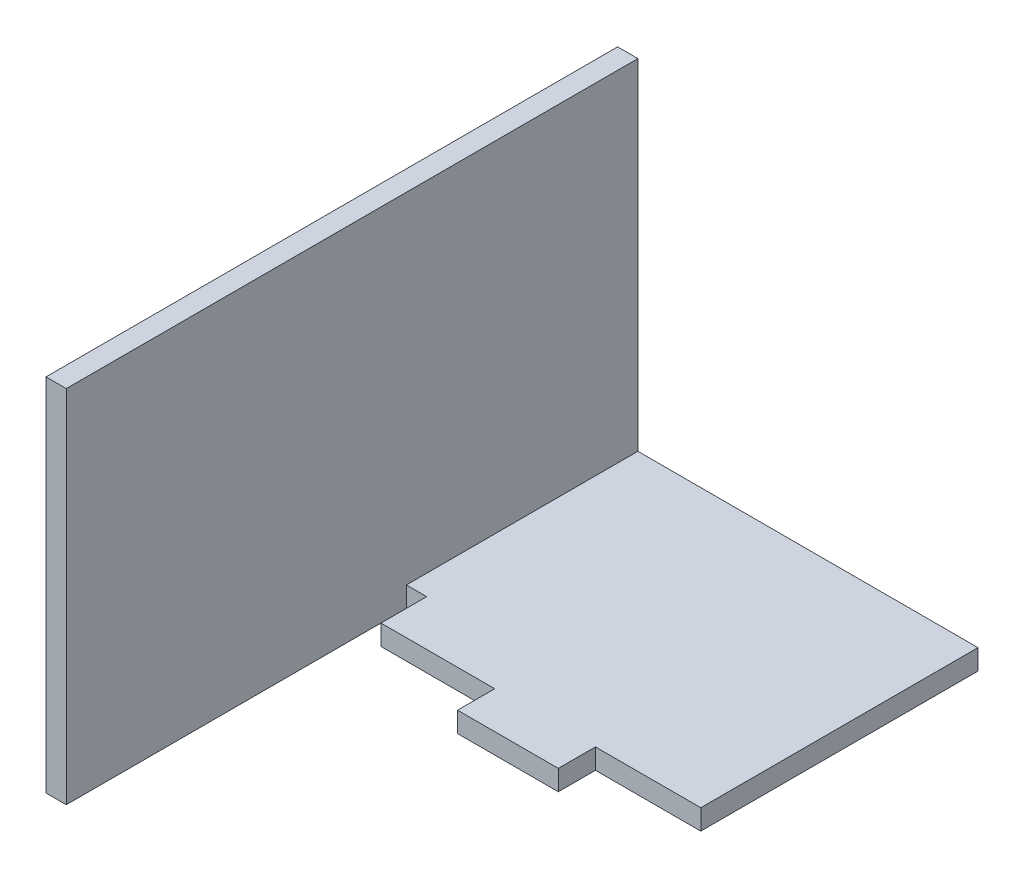
ISO-10303-21;
HEADER;
FILE_DESCRIPTION(('STEP AP214'),'2;1');
FILE_NAME('part.step','',(''),(''),'','','');
FILE_SCHEMA(('AUTOMOTIVE_DESIGN { 1 0 10303 214 1 1 1 1 }'));
ENDSEC;
DATA;
#1=APPLICATION_CONTEXT('core data for automotive mechanical design processes');
#2=APPLICATION_PROTOCOL_DEFINITION('international standard','automotive_design',2000,#1);
#3=PRODUCT_CONTEXT('',#1,'mechanical');
#4=PRODUCT('Part','Part','',(#3));
#5=PRODUCT_RELATED_PRODUCT_CATEGORY('part','',(#4));
#6=PRODUCT_DEFINITION_FORMATION('','',#4);
#7=PRODUCT_DEFINITION_CONTEXT('part definition',#1,'design');
#8=PRODUCT_DEFINITION('design','',#6,#7);
#9=PRODUCT_DEFINITION_SHAPE('','',#8);
#10=(LENGTH_UNIT() NAMED_UNIT(*) SI_UNIT(.MILLI.,.METRE.));
#11=(NAMED_UNIT(*) PLANE_ANGLE_UNIT() SI_UNIT($,.RADIAN.));
#12=(NAMED_UNIT(*) SI_UNIT($,.STERADIAN.) SOLID_ANGLE_UNIT());
#13=UNCERTAINTY_MEASURE_WITH_UNIT(LENGTH_MEASURE(1.E-05),#10,'distance_accuracy_value','');
#14=(GEOMETRIC_REPRESENTATION_CONTEXT(3) GLOBAL_UNCERTAINTY_ASSIGNED_CONTEXT((#13)) GLOBAL_UNIT_ASSIGNED_CONTEXT((#10,
#11,#12)) REPRESENTATION_CONTEXT('',''));
#15=CARTESIAN_POINT('',(0.,0.,0.));
#16=DIRECTION('',(0.,0.,1.));
#17=DIRECTION('',(1.,0.,0.));
#18=AXIS2_PLACEMENT_3D('',#15,#16,#17);
#19=CARTESIAN_POINT('',(1.42,-4.24660306919122E-12,40.0000000000007));
#20=DIRECTION('',(0.,-1.00000000000004,0.));
#21=DIRECTION('',(0.,0.,-1.00000000000004));
#22=AXIS2_PLACEMENT_3D('',#19,#20,#21);
#23=PLANE('',#22);
#24=DIRECTION('',(-1.,0.,0.));
#25=VECTOR('',#24,1.);
#26=CARTESIAN_POINT('',(1.42,0.,0.));
#27=LINE('',#26,#25);
#28=CARTESIAN_POINT('',(1.42,0.,0.));
#29=VERTEX_POINT('',#28);
#30=CARTESIAN_POINT('',(0.,0.,0.));
#31=VERTEX_POINT('',#30);
#32=EDGE_CURVE('E206',#29,#31,#27,.T.);
#33=ORIENTED_EDGE('',*,*,#32,.T.);
#34=DIRECTION('',(0.,0.,-1.00000000000004));
#35=VECTOR('',#34,1.);
#36=CARTESIAN_POINT('',(0.,-4.85722573273506E-12,40.0000000000005));
#37=LINE('',#36,#35);
#38=CARTESIAN_POINT('',(0.,-4.85722573273506E-12,40.0000000000005));
#39=VERTEX_POINT('',#38);
#40=EDGE_CURVE('E12',#39,#31,#37,.T.);
#41=ORIENTED_EDGE('',*,*,#40,.F.);
#42=DIRECTION('',(-1.,0.,0.));
#43=VECTOR('',#42,1.);
#44=CARTESIAN_POINT('',(1.42,-4.24660306919122E-12,40.0000000000007));
#45=LINE('',#44,#43);
#46=CARTESIAN_POINT('',(1.42,-4.24660306919122E-12,40.0000000000007));
#47=VERTEX_POINT('',#46);
#48=EDGE_CURVE('E213',#47,#39,#45,.T.);
#49=ORIENTED_EDGE('',*,*,#48,.F.);
#50=DIRECTION('',(0.,0.,-1.00000000000004));
#51=VECTOR('',#50,1.);
#52=CARTESIAN_POINT('',(1.42,-4.24660306919122E-12,40.0000000000007));
#53=LINE('',#52,#51);
#54=EDGE_CURVE('E185',#47,#29,#53,.T.);
#55=ORIENTED_EDGE('',*,*,#54,.T.);
#56=EDGE_LOOP('',(#33,#41,#49,#55));
#57=FACE_BOUND('',#56,.T.);
#58=ADVANCED_FACE('F61',(#57),#23,.F.);
#59=CARTESIAN_POINT('',(0.,-4.85722573273506E-12,40.0000000000005));
#60=DIRECTION('',(1.,0.,0.));
#61=DIRECTION('',(0.,0.,-1.00000000000004));
#62=AXIS2_PLACEMENT_3D('',#59,#60,#61);
#63=PLANE('',#62);
#64=DIRECTION('',(0.,-1.00000000000004,0.));
#65=VECTOR('',#64,1.);
#66=CARTESIAN_POINT('',(0.,0.,0.));
#67=LINE('',#66,#65);
#68=CARTESIAN_POINT('',(0.,-25.2200000000097,-4.85722573273506E-13));
#69=VERTEX_POINT('',#68);
#70=EDGE_CURVE('E202',#31,#69,#67,.T.);
#71=ORIENTED_EDGE('',*,*,#70,.T.);
#72=DIRECTION('',(0.,0.,-1.00000000000004));
#73=VECTOR('',#72,1.);
#74=CARTESIAN_POINT('',(0.,-25.22,39.9999999999995));
#75=LINE('',#74,#73);
#76=CARTESIAN_POINT('',(0.,-25.22,39.9999999999995));
#77=VERTEX_POINT('',#76);
#78=EDGE_CURVE('E68',#77,#69,#75,.T.);
#79=ORIENTED_EDGE('',*,*,#78,.F.);
#80=DIRECTION('',(0.,-1.00000000000004,0.));
#81=VECTOR('',#80,1.);
#82=CARTESIAN_POINT('',(0.,-4.85722573273506E-12,40.0000000000005));
#83=LINE('',#82,#81);
#84=EDGE_CURVE('E80',#39,#77,#83,.T.);
#85=ORIENTED_EDGE('',*,*,#84,.F.);
#86=ORIENTED_EDGE('',*,*,#40,.T.);
#87=EDGE_LOOP('',(#71,#79,#85,#86));
#88=FACE_BOUND('',#87,.T.);
#89=ADVANCED_FACE('F306',(#88),#63,.F.);
#90=CARTESIAN_POINT('',(25.22,-25.2200000000049,40.));
#91=DIRECTION('',(0.,1.00000000000004,0.));
#92=DIRECTION('',(-1.,0.,0.));
#93=AXIS2_PLACEMENT_3D('',#90,#91,#92);
#94=PLANE('',#93);
#95=DIRECTION('',(-1.,0.,0.));
#96=VECTOR('',#95,1.);
#97=CARTESIAN_POINT('',(1.4199999999994,-25.2200000000002,16.2000000000002));
#98=LINE('',#97,#96);
#99=CARTESIAN_POINT('',(2.84000000000001,-25.2200000000005,16.2000000000006));
#100=VERTEX_POINT('',#99);
#101=CARTESIAN_POINT('',(1.4199999999994,-25.2200000000002,16.2000000000002));
#102=VERTEX_POINT('',#101);
#103=EDGE_CURVE('E239',#100,#102,#98,.T.);
#104=ORIENTED_EDGE('',*,*,#103,.T.);
#105=DIRECTION('',(0.,0.,1.00000000000004));
#106=VECTOR('',#105,1.);
#107=CARTESIAN_POINT('',(1.42,-25.22,39.9999999999995));
#108=LINE('',#107,#106);
#109=CARTESIAN_POINT('',(1.42,-25.22,39.9999999999995));
#110=VERTEX_POINT('',#109);
#111=EDGE_CURVE('E165',#102,#110,#108,.T.);
#112=ORIENTED_EDGE('',*,*,#111,.T.);
#113=DIRECTION('',(1.,0.,0.));
#114=VECTOR('',#113,1.);
#115=CARTESIAN_POINT('',(25.22,-25.2200000000049,40.));
#116=LINE('',#115,#114);
#117=EDGE_CURVE('E197',#77,#110,#116,.T.);
#118=ORIENTED_EDGE('',*,*,#117,.F.);
#119=ORIENTED_EDGE('',*,*,#78,.T.);
#120=DIRECTION('',(1.,0.,0.));
#121=VECTOR('',#120,1.);
#122=CARTESIAN_POINT('',(25.22,-25.2200000000048,0.));
#123=LINE('',#122,#121);
#124=CARTESIAN_POINT('',(25.22,-25.2200000000048,0.));
#125=VERTEX_POINT('',#124);
#126=EDGE_CURVE('E195',#69,#125,#123,.T.);
#127=ORIENTED_EDGE('',*,*,#126,.T.);
#128=DIRECTION('',(0.,0.,-1.00000000000004));
#129=VECTOR('',#128,1.);
#130=CARTESIAN_POINT('',(25.22,-25.2200000000049,40.));
#131=LINE('',#130,#129);
#132=CARTESIAN_POINT('',(25.2199999999994,-25.2200000000048,19.4000000000002));
#133=VERTEX_POINT('',#132);
#134=EDGE_CURVE('E181',#133,#125,#131,.T.);
#135=ORIENTED_EDGE('',*,*,#134,.F.);
#136=DIRECTION('',(-1.,0.,0.));
#137=VECTOR('',#136,1.);
#138=CARTESIAN_POINT('',(17.8499999999994,-25.2200000000048,19.4));
#139=LINE('',#138,#137);
#140=CARTESIAN_POINT('',(17.8499999999994,-25.2200000000048,19.4));
#141=VERTEX_POINT('',#140);
#142=EDGE_CURVE('E160',#133,#141,#139,.T.);
#143=ORIENTED_EDGE('',*,*,#142,.T.);
#144=DIRECTION('',(0.,0.,1.00000000000004));
#145=VECTOR('',#144,1.);
#146=CARTESIAN_POINT('',(17.8499999999994,-25.22,22.));
#147=LINE('',#146,#145);
#148=CARTESIAN_POINT('',(17.8499999999994,-25.22,22.));
#149=VERTEX_POINT('',#148);
#150=EDGE_CURVE('E253',#141,#149,#147,.T.);
#151=ORIENTED_EDGE('',*,*,#150,.T.);
#152=DIRECTION('',(-1.,0.,0.));
#153=VECTOR('',#152,1.);
#154=CARTESIAN_POINT('',(10.7999999999996,-25.22,22.));
#155=LINE('',#154,#153);
#156=CARTESIAN_POINT('',(10.7999999999996,-25.22,22.));
#157=VERTEX_POINT('',#156);
#158=EDGE_CURVE('E250',#149,#157,#155,.T.);
#159=ORIENTED_EDGE('',*,*,#158,.T.);
#160=DIRECTION('',(0.,0.,-1.00000000000004));
#161=VECTOR('',#160,1.);
#162=CARTESIAN_POINT('',(10.7999999999996,-25.2200000000049,19.3999999999999));
#163=LINE('',#162,#161);
#164=CARTESIAN_POINT('',(10.7999999999996,-25.2200000000049,19.3999999999999));
#165=VERTEX_POINT('',#164);
#166=EDGE_CURVE('E247',#157,#165,#163,.T.);
#167=ORIENTED_EDGE('',*,*,#166,.T.);
#168=DIRECTION('',(-1.,0.,0.));
#169=VECTOR('',#168,1.);
#170=CARTESIAN_POINT('',(2.8399999999994,-25.22,19.4));
#171=LINE('',#170,#169);
#172=CARTESIAN_POINT('',(2.8399999999994,-25.22,19.4));
#173=VERTEX_POINT('',#172);
#174=EDGE_CURVE('E244',#165,#173,#171,.T.);
#175=ORIENTED_EDGE('',*,*,#174,.T.);
#176=DIRECTION('',(0.,0.,-1.00000000000004));
#177=VECTOR('',#176,1.);
#178=CARTESIAN_POINT('',(2.84000000000001,-25.2200000000005,16.2000000000006));
#179=LINE('',#178,#177);
#180=EDGE_CURVE('E241',#173,#100,#179,.T.);
#181=ORIENTED_EDGE('',*,*,#180,.T.);
#182=EDGE_LOOP('',(#104,#112,#118,#119,#127,#135,#143,#151,#159,#167,#175,#181));
#183=FACE_BOUND('',#182,.T.);
#184=ADVANCED_FACE('F194',(#183),#94,.F.);
#185=CARTESIAN_POINT('',(25.22,-25.2200000000049,40.));
#186=DIRECTION('',(-1.,0.,0.));
#187=DIRECTION('',(0.,0.,1.00000000000004));
#188=AXIS2_PLACEMENT_3D('',#185,#186,#187);
#189=PLANE('',#188);
#190=DIRECTION('',(0.,0.,-1.00000000000004));
#191=VECTOR('',#190,1.);
#192=CARTESIAN_POINT('',(25.22,-23.8000000000005,40.0000000000011));
#193=LINE('',#192,#191);
#194=CARTESIAN_POINT('',(25.2199999999994,-23.8000000000048,19.3999999999999));
#195=VERTEX_POINT('',#194);
#196=CARTESIAN_POINT('',(25.2199999999994,-23.8000000000004,-1.12410081243297E-12));
#197=VERTEX_POINT('',#196);
#198=EDGE_CURVE('E171',#195,#197,#193,.T.);
#199=ORIENTED_EDGE('',*,*,#198,.F.);
#200=DIRECTION('',(0.,1.00000000000004,0.));
#201=VECTOR('',#200,1.);
#202=CARTESIAN_POINT('',(25.2199999999994,-25.2200000000048,19.4000000000002));
#203=LINE('',#202,#201);
#204=EDGE_CURVE('E154',#133,#195,#203,.T.);
#205=ORIENTED_EDGE('',*,*,#204,.F.);
#206=ORIENTED_EDGE('',*,*,#134,.T.);
#207=DIRECTION('',(0.,1.00000000000004,0.));
#208=VECTOR('',#207,1.);
#209=CARTESIAN_POINT('',(25.22,-25.2200000000048,0.));
#210=LINE('',#209,#208);
#211=EDGE_CURVE('E179',#125,#197,#210,.T.);
#212=ORIENTED_EDGE('',*,*,#211,.T.);
#213=EDGE_LOOP('',(#199,#205,#206,#212));
#214=FACE_BOUND('',#213,.T.);
#215=ADVANCED_FACE('F177',(#214),#189,.F.);
#216=CARTESIAN_POINT('',(25.22,-23.8000000000005,40.0000000000011));
#217=DIRECTION('',(0.,-1.00000000000004,0.));
#218=DIRECTION('',(1.,0.,0.));
#219=AXIS2_PLACEMENT_3D('',#216,#217,#218);
#220=PLANE('',#219);
#221=DIRECTION('',(0.,0.,-1.00000000000004));
#222=VECTOR('',#221,1.);
#223=CARTESIAN_POINT('',(1.42,-23.8000000000049,40.0000000000006));
#224=LINE('',#223,#222);
#225=CARTESIAN_POINT('',(1.42,-23.8000000000058,16.2000000000002));
#226=VERTEX_POINT('',#225);
#227=CARTESIAN_POINT('',(1.42,-23.8000000000031,-8.46545056276682E-13));
#228=VERTEX_POINT('',#227);
#229=EDGE_CURVE('E182',#226,#228,#224,.T.);
#230=ORIENTED_EDGE('',*,*,#229,.F.);
#231=DIRECTION('',(-1.,0.,0.));
#232=VECTOR('',#231,1.);
#233=CARTESIAN_POINT('',(1.42,-23.8000000000058,16.2000000000002));
#234=LINE('',#233,#232);
#235=CARTESIAN_POINT('',(2.84,-23.8000000000047,16.2000000000003));
#236=VERTEX_POINT('',#235);
#237=EDGE_CURVE('E257',#236,#226,#234,.T.);
#238=ORIENTED_EDGE('',*,*,#237,.F.);
#239=DIRECTION('',(0.,0.,-1.00000000000004));
#240=VECTOR('',#239,1.);
#241=CARTESIAN_POINT('',(2.84,-23.8000000000047,16.2000000000003));
#242=LINE('',#241,#240);
#243=CARTESIAN_POINT('',(2.84,-23.8000000000049,19.4));
#244=VERTEX_POINT('',#243);
#245=EDGE_CURVE('E260',#244,#236,#242,.T.);
#246=ORIENTED_EDGE('',*,*,#245,.F.);
#247=DIRECTION('',(-1.,0.,0.));
#248=VECTOR('',#247,1.);
#249=CARTESIAN_POINT('',(2.84,-23.8000000000049,19.4));
#250=LINE('',#249,#248);
#251=CARTESIAN_POINT('',(10.7999999999997,-23.8000000000049,19.3999999999997));
#252=VERTEX_POINT('',#251);
#253=EDGE_CURVE('E263',#252,#244,#250,.T.);
#254=ORIENTED_EDGE('',*,*,#253,.F.);
#255=DIRECTION('',(0.,0.,-1.00000000000004));
#256=VECTOR('',#255,1.);
#257=CARTESIAN_POINT('',(10.7999999999997,-23.8000000000049,19.3999999999997));
#258=LINE('',#257,#256);
#259=CARTESIAN_POINT('',(10.7999999999997,-23.8000000000049,21.9999999999997));
#260=VERTEX_POINT('',#259);
#261=EDGE_CURVE('E266',#260,#252,#258,.T.);
#262=ORIENTED_EDGE('',*,*,#261,.F.);
#263=DIRECTION('',(-1.,0.,0.));
#264=VECTOR('',#263,1.);
#265=CARTESIAN_POINT('',(10.7999999999997,-23.8000000000049,21.9999999999997));
#266=LINE('',#265,#264);
#267=CARTESIAN_POINT('',(17.8499999999994,-23.8000000000049,21.9999999999998));
#268=VERTEX_POINT('',#267);
#269=EDGE_CURVE('E269',#268,#260,#266,.T.);
#270=ORIENTED_EDGE('',*,*,#269,.F.);
#271=DIRECTION('',(0.,0.,1.00000000000004));
#272=VECTOR('',#271,1.);
#273=CARTESIAN_POINT('',(17.8499999999994,-23.8000000000049,21.9999999999998));
#274=LINE('',#273,#272);
#275=CARTESIAN_POINT('',(17.8499999999994,-23.8000000000048,19.3999999999998));
#276=VERTEX_POINT('',#275);
#277=EDGE_CURVE('E175',#276,#268,#274,.T.);
#278=ORIENTED_EDGE('',*,*,#277,.F.);
#279=DIRECTION('',(-1.,0.,0.));
#280=VECTOR('',#279,1.);
#281=CARTESIAN_POINT('',(17.8499999999994,-23.8000000000048,19.3999999999998));
#282=LINE('',#281,#280);
#283=EDGE_CURVE('E157',#195,#276,#282,.T.);
#284=ORIENTED_EDGE('',*,*,#283,.F.);
#285=ORIENTED_EDGE('',*,*,#198,.T.);
#286=DIRECTION('',(-1.,0.,0.));
#287=VECTOR('',#286,1.);
#288=CARTESIAN_POINT('',(25.2199999999994,-23.8000000000004,-1.12410081243297E-12));
#289=LINE('',#288,#287);
#290=EDGE_CURVE('E204',#197,#228,#289,.T.);
#291=ORIENTED_EDGE('',*,*,#290,.T.);
#292=EDGE_LOOP('',(#230,#238,#246,#254,#262,#270,#278,#284,#285,#291));
#293=FACE_BOUND('',#292,.T.);
#294=ADVANCED_FACE('F169',(#293),#220,.F.);
#295=CARTESIAN_POINT('',(1.42,-4.24660306919122E-12,40.0000000000007));
#296=DIRECTION('',(-1.,0.,0.));
#297=DIRECTION('',(0.,-1.00000000000004,0.));
#298=AXIS2_PLACEMENT_3D('',#295,#296,#297);
#299=PLANE('',#298);
#300=DIRECTION('',(0.,1.00000000000004,0.));
#301=VECTOR('',#300,1.);
#302=CARTESIAN_POINT('',(1.42,0.,0.));
#303=LINE('',#302,#301);
#304=EDGE_CURVE('E211',#228,#29,#303,.T.);
#305=ORIENTED_EDGE('',*,*,#304,.T.);
#306=ORIENTED_EDGE('',*,*,#54,.F.);
#307=DIRECTION('',(0.,1.00000000000004,0.));
#308=VECTOR('',#307,1.);
#309=CARTESIAN_POINT('',(1.42,-4.24660306919122E-12,40.0000000000007));
#310=LINE('',#309,#308);
#311=EDGE_CURVE('E75',#110,#47,#310,.T.);
#312=ORIENTED_EDGE('',*,*,#311,.F.);
#313=ORIENTED_EDGE('',*,*,#111,.F.);
#314=DIRECTION('',(0.,1.00000000000004,0.));
#315=VECTOR('',#314,1.);
#316=CARTESIAN_POINT('',(1.4199999999994,-25.2200000000002,16.2000000000002));
#317=LINE('',#316,#315);
#318=EDGE_CURVE('E224',#102,#226,#317,.T.);
#319=ORIENTED_EDGE('',*,*,#318,.T.);
#320=ORIENTED_EDGE('',*,*,#229,.T.);
#321=EDGE_LOOP('',(#305,#306,#312,#313,#319,#320));
#322=FACE_BOUND('',#321,.T.);
#323=ADVANCED_FACE('F295',(#322),#299,.F.);
#324=CARTESIAN_POINT('',(0.,-4.85722573273506E-12,40.0000000000005));
#325=DIRECTION('',(0.,0.,1.00000000000004));
#326=DIRECTION('',(1.,0.,0.));
#327=AXIS2_PLACEMENT_3D('',#324,#325,#326);
#328=PLANE('',#327);
#329=ORIENTED_EDGE('',*,*,#117,.T.);
#330=ORIENTED_EDGE('',*,*,#311,.T.);
#331=ORIENTED_EDGE('',*,*,#48,.T.);
#332=ORIENTED_EDGE('',*,*,#84,.T.);
#333=EDGE_LOOP('',(#329,#330,#331,#332));
#334=FACE_BOUND('',#333,.T.);
#335=ADVANCED_FACE('F297',(#334),#328,.T.);
#336=CARTESIAN_POINT('',(0.,0.,0.));
#337=DIRECTION('',(0.,0.,1.00000000000004));
#338=DIRECTION('',(1.,0.,0.));
#339=AXIS2_PLACEMENT_3D('',#336,#337,#338);
#340=PLANE('',#339);
#341=ORIENTED_EDGE('',*,*,#32,.F.);
#342=ORIENTED_EDGE('',*,*,#304,.F.);
#343=ORIENTED_EDGE('',*,*,#290,.F.);
#344=ORIENTED_EDGE('',*,*,#211,.F.);
#345=ORIENTED_EDGE('',*,*,#126,.F.);
#346=ORIENTED_EDGE('',*,*,#70,.F.);
#347=EDGE_LOOP('',(#341,#342,#343,#344,#345,#346));
#348=FACE_BOUND('',#347,.T.);
#349=ADVANCED_FACE('F201',(#348),#340,.F.);
#350=CARTESIAN_POINT('',(1.4199999999994,-25.2200000000002,16.2000000000002));
#351=DIRECTION('',(0.,0.,-1.00000000000004));
#352=DIRECTION('',(-1.,0.,0.));
#353=AXIS2_PLACEMENT_3D('',#350,#351,#352);
#354=PLANE('',#353);
#355=ORIENTED_EDGE('',*,*,#237,.T.);
#356=ORIENTED_EDGE('',*,*,#318,.F.);
#357=ORIENTED_EDGE('',*,*,#103,.F.);
#358=DIRECTION('',(0.,1.00000000000004,0.));
#359=VECTOR('',#358,1.);
#360=CARTESIAN_POINT('',(2.84000000000001,-25.2200000000005,16.2000000000006));
#361=LINE('',#360,#359);
#362=EDGE_CURVE('E225',#100,#236,#361,.T.);
#363=ORIENTED_EDGE('',*,*,#362,.T.);
#364=EDGE_LOOP('',(#355,#356,#357,#363));
#365=FACE_BOUND('',#364,.T.);
#366=ADVANCED_FACE('F293',(#365),#354,.F.);
#367=CARTESIAN_POINT('',(2.84000000000001,-25.2200000000005,16.2000000000006));
#368=DIRECTION('',(1.,0.,0.));
#369=DIRECTION('',(0.,1.00000000000004,0.));
#370=AXIS2_PLACEMENT_3D('',#367,#368,#369);
#371=PLANE('',#370);
#372=ORIENTED_EDGE('',*,*,#245,.T.);
#373=ORIENTED_EDGE('',*,*,#362,.F.);
#374=ORIENTED_EDGE('',*,*,#180,.F.);
#375=DIRECTION('',(0.,1.00000000000004,0.));
#376=VECTOR('',#375,1.);
#377=CARTESIAN_POINT('',(2.8399999999994,-25.22,19.4));
#378=LINE('',#377,#376);
#379=EDGE_CURVE('E235',#173,#244,#378,.T.);
#380=ORIENTED_EDGE('',*,*,#379,.T.);
#381=EDGE_LOOP('',(#372,#373,#374,#380));
#382=FACE_BOUND('',#381,.T.);
#383=ADVANCED_FACE('F289',(#382),#371,.F.);
#384=CARTESIAN_POINT('',(2.8399999999994,-25.22,19.4));
#385=DIRECTION('',(0.,0.,-1.00000000000004));
#386=DIRECTION('',(-1.,0.,0.));
#387=AXIS2_PLACEMENT_3D('',#384,#385,#386);
#388=PLANE('',#387);
#389=ORIENTED_EDGE('',*,*,#253,.T.);
#390=ORIENTED_EDGE('',*,*,#379,.F.);
#391=ORIENTED_EDGE('',*,*,#174,.F.);
#392=DIRECTION('',(0.,1.00000000000004,0.));
#393=VECTOR('',#392,1.);
#394=CARTESIAN_POINT('',(10.7999999999996,-25.2200000000049,19.3999999999999));
#395=LINE('',#394,#393);
#396=EDGE_CURVE('E233',#165,#252,#395,.T.);
#397=ORIENTED_EDGE('',*,*,#396,.T.);
#398=EDGE_LOOP('',(#389,#390,#391,#397));
#399=FACE_BOUND('',#398,.T.);
#400=ADVANCED_FACE('F285',(#399),#388,.F.);
#401=CARTESIAN_POINT('',(10.7999999999996,-25.2200000000049,19.3999999999999));
#402=DIRECTION('',(1.,0.,0.));
#403=DIRECTION('',(0.,1.00000000000004,0.));
#404=AXIS2_PLACEMENT_3D('',#401,#402,#403);
#405=PLANE('',#404);
#406=ORIENTED_EDGE('',*,*,#261,.T.);
#407=ORIENTED_EDGE('',*,*,#396,.F.);
#408=ORIENTED_EDGE('',*,*,#166,.F.);
#409=DIRECTION('',(0.,1.00000000000004,0.));
#410=VECTOR('',#409,1.);
#411=CARTESIAN_POINT('',(10.7999999999996,-25.22,22.));
#412=LINE('',#411,#410);
#413=EDGE_CURVE('E231',#157,#260,#412,.T.);
#414=ORIENTED_EDGE('',*,*,#413,.T.);
#415=EDGE_LOOP('',(#406,#407,#408,#414));
#416=FACE_BOUND('',#415,.T.);
#417=ADVANCED_FACE('F283',(#416),#405,.F.);
#418=CARTESIAN_POINT('',(10.7999999999996,-25.22,22.));
#419=DIRECTION('',(0.,0.,-1.00000000000004));
#420=DIRECTION('',(-1.,0.,0.));
#421=AXIS2_PLACEMENT_3D('',#418,#419,#420);
#422=PLANE('',#421);
#423=ORIENTED_EDGE('',*,*,#269,.T.);
#424=ORIENTED_EDGE('',*,*,#413,.F.);
#425=ORIENTED_EDGE('',*,*,#158,.F.);
#426=DIRECTION('',(0.,1.00000000000004,0.));
#427=VECTOR('',#426,1.);
#428=CARTESIAN_POINT('',(17.8499999999994,-25.22,22.));
#429=LINE('',#428,#427);
#430=EDGE_CURVE('E229',#149,#268,#429,.T.);
#431=ORIENTED_EDGE('',*,*,#430,.T.);
#432=EDGE_LOOP('',(#423,#424,#425,#431));
#433=FACE_BOUND('',#432,.T.);
#434=ADVANCED_FACE('F279',(#433),#422,.F.);
#435=CARTESIAN_POINT('',(17.8499999999994,-25.22,22.));
#436=DIRECTION('',(-1.,0.,0.));
#437=DIRECTION('',(0.,-1.00000000000004,0.));
#438=AXIS2_PLACEMENT_3D('',#435,#436,#437);
#439=PLANE('',#438);
#440=ORIENTED_EDGE('',*,*,#277,.T.);
#441=ORIENTED_EDGE('',*,*,#430,.F.);
#442=ORIENTED_EDGE('',*,*,#150,.F.);
#443=DIRECTION('',(0.,1.00000000000004,0.));
#444=VECTOR('',#443,1.);
#445=CARTESIAN_POINT('',(17.8499999999994,-25.2200000000048,19.4));
#446=LINE('',#445,#444);
#447=EDGE_CURVE('E164',#141,#276,#446,.T.);
#448=ORIENTED_EDGE('',*,*,#447,.T.);
#449=EDGE_LOOP('',(#440,#441,#442,#448));
#450=FACE_BOUND('',#449,.T.);
#451=ADVANCED_FACE('F273',(#450),#439,.F.);
#452=CARTESIAN_POINT('',(17.8499999999994,-25.2200000000048,19.4));
#453=DIRECTION('',(0.,0.,-1.00000000000004));
#454=DIRECTION('',(-1.,0.,0.));
#455=AXIS2_PLACEMENT_3D('',#452,#453,#454);
#456=PLANE('',#455);
#457=ORIENTED_EDGE('',*,*,#283,.T.);
#458=ORIENTED_EDGE('',*,*,#447,.F.);
#459=ORIENTED_EDGE('',*,*,#142,.F.);
#460=ORIENTED_EDGE('',*,*,#204,.T.);
#461=EDGE_LOOP('',(#457,#458,#459,#460));
#462=FACE_BOUND('',#461,.T.);
#463=ADVANCED_FACE('F156',(#462),#456,.F.);
#464=CLOSED_SHELL('',(#58,#89,#184,#215,#294,#323,#335,#349,#366,#383,#400,#417,#434,#451,#463));
#465=MANIFOLD_SOLID_BREP('B2',#464);
#466=ADVANCED_BREP_SHAPE_REPRESENTATION('',(#18,#465),#14);
#467=SHAPE_DEFINITION_REPRESENTATION(#9,#466);
ENDSEC;
END-ISO-10303-21;
